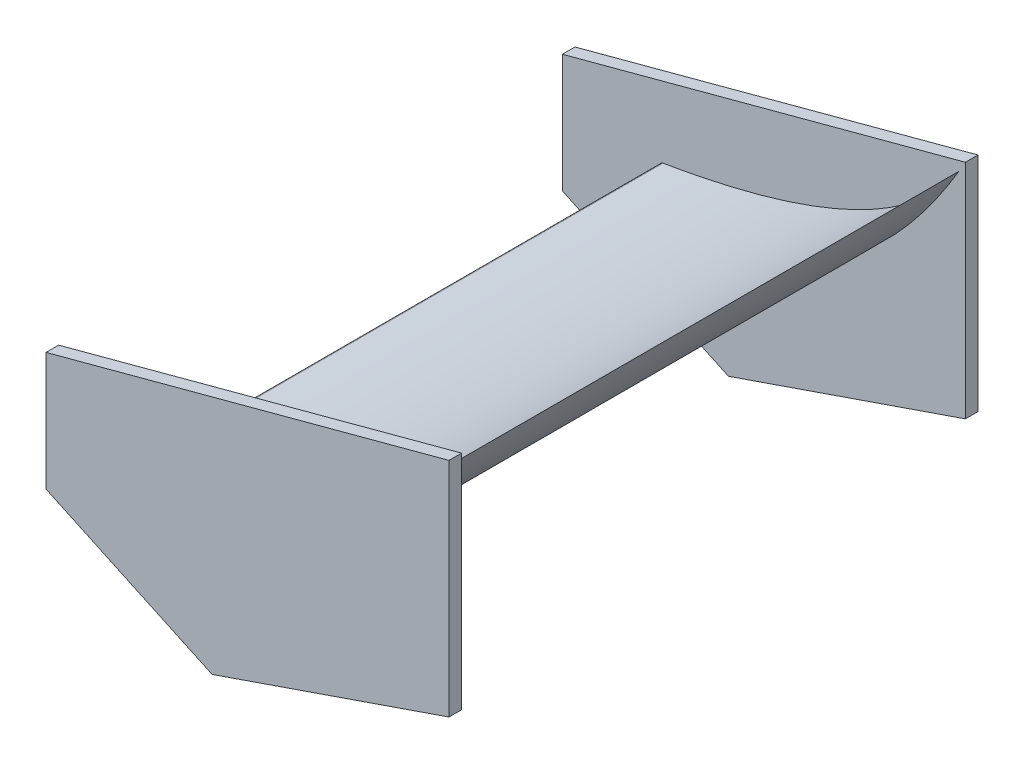
ISO-10303-21;
HEADER;
FILE_DESCRIPTION(('STEP AP214'),'2;1');
FILE_NAME('part.step','',(''),(''),'','','');
FILE_SCHEMA(('AUTOMOTIVE_DESIGN { 1 0 10303 214 1 1 1 1 }'));
ENDSEC;
DATA;
#1=APPLICATION_CONTEXT('core data for automotive mechanical design processes');
#2=APPLICATION_PROTOCOL_DEFINITION('international standard','automotive_design',2000,#1);
#3=PRODUCT_CONTEXT('',#1,'mechanical');
#4=PRODUCT('Part','Part','',(#3));
#5=PRODUCT_RELATED_PRODUCT_CATEGORY('part','',(#4));
#6=PRODUCT_DEFINITION_FORMATION('','',#4);
#7=PRODUCT_DEFINITION_CONTEXT('part definition',#1,'design');
#8=PRODUCT_DEFINITION('design','',#6,#7);
#9=PRODUCT_DEFINITION_SHAPE('','',#8);
#10=(LENGTH_UNIT() NAMED_UNIT(*) SI_UNIT(.MILLI.,.METRE.));
#11=(NAMED_UNIT(*) PLANE_ANGLE_UNIT() SI_UNIT($,.RADIAN.));
#12=(NAMED_UNIT(*) SI_UNIT($,.STERADIAN.) SOLID_ANGLE_UNIT());
#13=UNCERTAINTY_MEASURE_WITH_UNIT(LENGTH_MEASURE(1.E-05),#10,'distance_accuracy_value','');
#14=(GEOMETRIC_REPRESENTATION_CONTEXT(3) GLOBAL_UNCERTAINTY_ASSIGNED_CONTEXT((#13)) GLOBAL_UNIT_ASSIGNED_CONTEXT((#10,
#11,#12)) REPRESENTATION_CONTEXT('',''));
#15=CARTESIAN_POINT('',(0.,0.,0.));
#16=DIRECTION('',(0.,0.,1.));
#17=DIRECTION('',(1.,0.,0.));
#18=AXIS2_PLACEMENT_3D('',#15,#16,#17);
#19=CARTESIAN_POINT('',(381.424295223492,794.650430858613,500.));
#20=DIRECTION('',(0.,0.,-1.));
#21=DIRECTION('',(-1.,0.,0.));
#22=AXIS2_PLACEMENT_3D('',#19,#20,#21);
#23=CYLINDRICAL_SURFACE('',#22,7.00000000000001);
#24=CARTESIAN_POINT('',(381.424295223492,794.650430858613,-500.));
#25=DIRECTION('',(0.,0.,1.));
#26=DIRECTION('',(1.,0.,0.));
#27=AXIS2_PLACEMENT_3D('',#24,#25,#26);
#28=CIRCLE('',#27,7.00000000000001);
#29=CARTESIAN_POINT('',(380.27721687436,801.555806392279,-500.));
#30=VERTEX_POINT('',#29);
#31=CARTESIAN_POINT('',(375.337243967888,791.193870861788,-500.));
#32=VERTEX_POINT('',#31);
#33=EDGE_CURVE('E98',#30,#32,#28,.T.);
#34=ORIENTED_EDGE('',*,*,#33,.T.);
#35=DIRECTION('',(0.,0.,-1.));
#36=VECTOR('',#35,1.);
#37=CARTESIAN_POINT('',(375.337243967888,791.193870861788,500.));
#38=LINE('',#37,#36);
#39=CARTESIAN_POINT('',(375.337243967888,791.193870861788,500.));
#40=VERTEX_POINT('',#39);
#41=EDGE_CURVE('E12',#40,#32,#38,.T.);
#42=ORIENTED_EDGE('',*,*,#41,.F.);
#43=CARTESIAN_POINT('',(381.424295223492,794.650430858613,500.));
#44=DIRECTION('',(0.,0.,1.));
#45=DIRECTION('',(1.,0.,0.));
#46=AXIS2_PLACEMENT_3D('',#43,#44,#45);
#47=CIRCLE('',#46,7.00000000000001);
#48=CARTESIAN_POINT('',(380.27721687436,801.555806392279,500.));
#49=VERTEX_POINT('',#48);
#50=EDGE_CURVE('E91',#49,#40,#47,.T.);
#51=ORIENTED_EDGE('',*,*,#50,.F.);
#52=DIRECTION('',(0.,0.,-1.));
#53=VECTOR('',#52,1.);
#54=CARTESIAN_POINT('',(380.27721687436,801.555806392279,500.));
#55=LINE('',#54,#53);
#56=EDGE_CURVE('E99',#49,#30,#55,.T.);
#57=ORIENTED_EDGE('',*,*,#56,.T.);
#58=EDGE_LOOP('',(#34,#42,#51,#57));
#59=FACE_BOUND('',#58,.T.);
#60=ADVANCED_FACE('F51',(#59),#23,.T.);
#61=CARTESIAN_POINT('',(375.337243967888,791.193870861788,500.));
#62=CARTESIAN_POINT('',(722.629462289645,653.636276188608,500.));
#63=CARTESIAN_POINT('',(980.27721687436,1103.11161278456,500.));
#64=B_SPLINE_CURVE_WITH_KNOTS('',2,(#61,#62,#63),.UNSPECIFIED.,.F.,.F.,(3,3),(0.,1.),.UNSPECIFIED.);
#65=DIRECTION('',(0.,0.,-1.));
#66=VECTOR('',#65,1.);
#67=SURFACE_OF_LINEAR_EXTRUSION('',#64,#66);
#68=CARTESIAN_POINT('',(375.337243967888,791.193870861788,-500.));
#69=CARTESIAN_POINT('',(722.629462289645,653.636276188608,-500.));
#70=CARTESIAN_POINT('',(980.27721687436,1103.11161278456,-500.));
#71=B_SPLINE_CURVE_WITH_KNOTS('',2,(#68,#69,#70),.UNSPECIFIED.,.F.,.F.,(3,3),(0.,1.),.UNSPECIFIED.);
#72=CARTESIAN_POINT('',(967.403573874035,1081.11311876212,-500.));
#73=VERTEX_POINT('',#72);
#74=EDGE_CURVE('E79',#32,#73,#71,.T.);
#75=ORIENTED_EDGE('',*,*,#74,.T.);
#76=DIRECTION('',(0.,0.,-1.));
#77=VECTOR('',#76,1.);
#78=CARTESIAN_POINT('',(967.403573874035,1081.11311876212,500.));
#79=LINE('',#78,#77);
#80=CARTESIAN_POINT('',(967.403573874035,1081.11311876212,500.));
#81=VERTEX_POINT('',#80);
#82=EDGE_CURVE('E59',#81,#73,#79,.T.);
#83=ORIENTED_EDGE('',*,*,#82,.F.);
#84=EDGE_CURVE('E87',#40,#81,#64,.T.);
#85=ORIENTED_EDGE('',*,*,#84,.F.);
#86=ORIENTED_EDGE('',*,*,#41,.T.);
#87=EDGE_LOOP('',(#75,#83,#85,#86));
#88=FACE_BOUND('',#87,.T.);
#89=ADVANCED_FACE('F88',(#88),#67,.F.);
#90=CARTESIAN_POINT('',(980.27721687436,1103.11161278456,500.));
#91=CARTESIAN_POINT('',(861.874697213353,881.555806392279,500.));
#92=CARTESIAN_POINT('',(380.27721687436,801.555806392279,500.));
#93=B_SPLINE_CURVE_WITH_KNOTS('',2,(#90,#91,#92),.UNSPECIFIED.,.F.,.F.,(3,3),(0.,1.),.UNSPECIFIED.);
#94=DIRECTION('',(0.,0.,-1.));
#95=VECTOR('',#94,1.);
#96=SURFACE_OF_LINEAR_EXTRUSION('',#93,#95);
#97=CARTESIAN_POINT('',(980.27721687436,1103.11161278456,-500.));
#98=CARTESIAN_POINT('',(861.874697213353,881.555806392279,-500.));
#99=CARTESIAN_POINT('',(380.27721687436,801.555806392279,-500.));
#100=B_SPLINE_CURVE_WITH_KNOTS('',2,(#97,#98,#99),.UNSPECIFIED.,.F.,.F.,(3,3),(0.,1.),.UNSPECIFIED.);
#101=EDGE_CURVE('E84',#73,#30,#100,.T.);
#102=ORIENTED_EDGE('',*,*,#101,.T.);
#103=ORIENTED_EDGE('',*,*,#56,.F.);
#104=EDGE_CURVE('E67',#81,#49,#93,.T.);
#105=ORIENTED_EDGE('',*,*,#104,.F.);
#106=ORIENTED_EDGE('',*,*,#82,.T.);
#107=EDGE_LOOP('',(#102,#103,#105,#106));
#108=FACE_BOUND('',#107,.T.);
#109=ADVANCED_FACE('F119',(#108),#96,.F.);
#110=CARTESIAN_POINT('',(0.,0.,500.));
#111=DIRECTION('',(0.,0.,1.));
#112=DIRECTION('',(1.,0.,0.));
#113=AXIS2_PLACEMENT_3D('',#110,#111,#112);
#114=PLANE('',#113);
#115=ORIENTED_EDGE('',*,*,#50,.T.);
#116=ORIENTED_EDGE('',*,*,#84,.T.);
#117=ORIENTED_EDGE('',*,*,#104,.T.);
#118=EDGE_LOOP('',(#115,#116,#117));
#119=FACE_BOUND('',#118,.T.);
#120=ADVANCED_FACE('F94',(#119),#114,.T.);
#121=CARTESIAN_POINT('',(0.,0.,-500.));
#122=DIRECTION('',(0.,0.,1.));
#123=DIRECTION('',(1.,0.,0.));
#124=AXIS2_PLACEMENT_3D('',#121,#122,#123);
#125=PLANE('',#124);
#126=ORIENTED_EDGE('',*,*,#33,.F.);
#127=ORIENTED_EDGE('',*,*,#101,.F.);
#128=ORIENTED_EDGE('',*,*,#74,.F.);
#129=EDGE_LOOP('',(#126,#127,#128));
#130=FACE_BOUND('',#129,.T.);
#131=ADVANCED_FACE('F120',(#130),#125,.F.);
#132=CLOSED_SHELL('',(#60,#89,#109,#120,#131));
#133=MANIFOLD_SOLID_BREP('B2',#132);
#134=CARTESIAN_POINT('',(980.27721687436,0.,-525.));
#135=DIRECTION('',(1.,0.,0.));
#136=DIRECTION('',(0.,0.,1.));
#137=AXIS2_PLACEMENT_3D('',#134,#135,#136);
#138=PLANE('',#137);
#139=DIRECTION('',(0.,-1.,0.));
#140=VECTOR('',#139,1.);
#141=CARTESIAN_POINT('',(980.27721687436,0.,-500.));
#142=LINE('',#141,#140);
#143=CARTESIAN_POINT('',(980.27721687436,1103.11161278456,-500.));
#144=VERTEX_POINT('',#143);
#145=CARTESIAN_POINT('',(980.27721687436,661.929431670851,-500.));
#146=VERTEX_POINT('',#145);
#147=EDGE_CURVE('E254',#144,#146,#142,.T.);
#148=ORIENTED_EDGE('',*,*,#147,.T.);
#149=DIRECTION('',(0.,0.,1.));
#150=VECTOR('',#149,1.);
#151=CARTESIAN_POINT('',(980.27721687436,661.929431670851,-525.));
#152=LINE('',#151,#150);
#153=CARTESIAN_POINT('',(980.27721687436,661.929431670851,-525.));
#154=VERTEX_POINT('',#153);
#155=EDGE_CURVE('E253',#154,#146,#152,.T.);
#156=ORIENTED_EDGE('',*,*,#155,.F.);
#157=DIRECTION('',(0.,-1.,0.));
#158=VECTOR('',#157,1.);
#159=CARTESIAN_POINT('',(980.27721687436,0.,-525.));
#160=LINE('',#159,#158);
#161=CARTESIAN_POINT('',(980.27721687436,1103.11161278456,-525.));
#162=VERTEX_POINT('',#161);
#163=EDGE_CURVE('E248',#162,#154,#160,.T.);
#164=ORIENTED_EDGE('',*,*,#163,.F.);
#165=DIRECTION('',(0.,0.,1.));
#166=VECTOR('',#165,1.);
#167=CARTESIAN_POINT('',(980.27721687436,1103.11161278456,-525.));
#168=LINE('',#167,#166);
#169=EDGE_CURVE('E49',#162,#144,#168,.T.);
#170=ORIENTED_EDGE('',*,*,#169,.T.);
#171=EDGE_LOOP('',(#148,#156,#164,#170));
#172=FACE_BOUND('',#171,.T.);
#173=ADVANCED_FACE('F179',(#172),#138,.T.);
#174=CARTESIAN_POINT('',(-210.11178104111,784.147842114219,-525.));
#175=DIRECTION('',(0.258819045102518,-0.965925826289069,0.));
#176=DIRECTION('',(0.965925826289069,0.258819045102518,0.));
#177=AXIS2_PLACEMENT_3D('',#174,#175,#176);
#178=PLANE('',#177);
#179=DIRECTION('',(-0.965925826289069,-0.258819045102518,0.));
#180=VECTOR('',#179,1.);
#181=CARTESIAN_POINT('',(-210.11178104111,784.147842114219,-500.));
#182=LINE('',#181,#180);
#183=CARTESIAN_POINT('',(180.27721687436,888.752258839663,-500.));
#184=VERTEX_POINT('',#183);
#185=EDGE_CURVE('E257',#144,#184,#182,.T.);
#186=ORIENTED_EDGE('',*,*,#185,.F.);
#187=ORIENTED_EDGE('',*,*,#169,.F.);
#188=DIRECTION('',(-0.965925826289069,-0.258819045102518,0.));
#189=VECTOR('',#188,1.);
#190=CARTESIAN_POINT('',(-210.11178104111,784.147842114219,-525.));
#191=LINE('',#190,#189);
#192=CARTESIAN_POINT('',(180.27721687436,888.752258839663,-525.));
#193=VERTEX_POINT('',#192);
#194=EDGE_CURVE('E224',#162,#193,#191,.T.);
#195=ORIENTED_EDGE('',*,*,#194,.T.);
#196=DIRECTION('',(0.,0.,1.));
#197=VECTOR('',#196,1.);
#198=CARTESIAN_POINT('',(180.27721687436,888.752258839663,-525.));
#199=LINE('',#198,#197);
#200=EDGE_CURVE('E187',#193,#184,#199,.T.);
#201=ORIENTED_EDGE('',*,*,#200,.T.);
#202=EDGE_LOOP('',(#186,#187,#195,#201));
#203=FACE_BOUND('',#202,.T.);
#204=ADVANCED_FACE('F266',(#203),#178,.F.);
#205=CARTESIAN_POINT('',(180.27721687436,0.,-525.));
#206=DIRECTION('',(1.,0.,0.));
#207=DIRECTION('',(0.,1.,0.));
#208=AXIS2_PLACEMENT_3D('',#205,#206,#207);
#209=PLANE('',#208);
#210=DIRECTION('',(0.,-1.,0.));
#211=VECTOR('',#210,1.);
#212=CARTESIAN_POINT('',(180.27721687436,0.,-500.));
#213=LINE('',#212,#211);
#214=CARTESIAN_POINT('',(180.27721687436,653.752258839663,-500.));
#215=VERTEX_POINT('',#214);
#216=EDGE_CURVE('E260',#184,#215,#213,.T.);
#217=ORIENTED_EDGE('',*,*,#216,.F.);
#218=ORIENTED_EDGE('',*,*,#200,.F.);
#219=DIRECTION('',(0.,-1.,0.));
#220=VECTOR('',#219,1.);
#221=CARTESIAN_POINT('',(180.27721687436,0.,-525.));
#222=LINE('',#221,#220);
#223=CARTESIAN_POINT('',(180.27721687436,653.752258839663,-525.));
#224=VERTEX_POINT('',#223);
#225=EDGE_CURVE('E233',#193,#224,#222,.T.);
#226=ORIENTED_EDGE('',*,*,#225,.T.);
#227=DIRECTION('',(0.,0.,1.));
#228=VECTOR('',#227,1.);
#229=CARTESIAN_POINT('',(180.27721687436,653.752258839663,-525.));
#230=LINE('',#229,#228);
#231=EDGE_CURVE('E238',#224,#215,#230,.T.);
#232=ORIENTED_EDGE('',*,*,#231,.T.);
#233=EDGE_LOOP('',(#217,#218,#226,#232));
#234=FACE_BOUND('',#233,.T.);
#235=ADVANCED_FACE('F245',(#234),#209,.F.);
#236=CARTESIAN_POINT('',(282.600270309672,606.038235416975,-525.));
#237=DIRECTION('',(0.422618261740693,0.906307787036653,0.));
#238=DIRECTION('',(-0.906307787036653,0.422618261740693,0.));
#239=AXIS2_PLACEMENT_3D('',#236,#237,#238);
#240=PLANE('',#239);
#241=DIRECTION('',(0.906307787036653,-0.422618261740693,0.));
#242=VECTOR('',#241,1.);
#243=CARTESIAN_POINT('',(282.600270309672,606.038235416975,-500.));
#244=LINE('',#243,#242);
#245=CARTESIAN_POINT('',(510.,500.,-500.));
#246=VERTEX_POINT('',#245);
#247=EDGE_CURVE('E240',#215,#246,#244,.T.);
#248=ORIENTED_EDGE('',*,*,#247,.F.);
#249=ORIENTED_EDGE('',*,*,#231,.F.);
#250=DIRECTION('',(0.906307787036653,-0.422618261740693,0.));
#251=VECTOR('',#250,1.);
#252=CARTESIAN_POINT('',(282.600270309672,606.038235416975,-525.));
#253=LINE('',#252,#251);
#254=CARTESIAN_POINT('',(510.,500.,-525.));
#255=VERTEX_POINT('',#254);
#256=EDGE_CURVE('E229',#224,#255,#253,.T.);
#257=ORIENTED_EDGE('',*,*,#256,.T.);
#258=DIRECTION('',(0.,0.,1.));
#259=VECTOR('',#258,1.);
#260=CARTESIAN_POINT('',(510.,500.,-525.));
#261=LINE('',#260,#259);
#262=EDGE_CURVE('E243',#255,#246,#261,.T.);
#263=ORIENTED_EDGE('',*,*,#262,.T.);
#264=EDGE_LOOP('',(#248,#249,#257,#263));
#265=FACE_BOUND('',#264,.T.);
#266=ADVANCED_FACE('F239',(#265),#240,.F.);
#267=CARTESIAN_POINT('',(-99.8581110011282,290.009012193642,-525.));
#268=DIRECTION('',(-0.325568154457151,0.945518575599319,0.));
#269=DIRECTION('',(-0.945518575599319,-0.325568154457151,0.));
#270=AXIS2_PLACEMENT_3D('',#267,#268,#269);
#271=PLANE('',#270);
#272=DIRECTION('',(0.945518575599319,0.325568154457151,0.));
#273=VECTOR('',#272,1.);
#274=CARTESIAN_POINT('',(-99.8581110011282,290.009012193642,-500.));
#275=LINE('',#274,#273);
#276=EDGE_CURVE('E212',#246,#146,#275,.T.);
#277=ORIENTED_EDGE('',*,*,#276,.F.);
#278=ORIENTED_EDGE('',*,*,#262,.F.);
#279=DIRECTION('',(0.945518575599319,0.325568154457151,0.));
#280=VECTOR('',#279,1.);
#281=CARTESIAN_POINT('',(-99.8581110011282,290.009012193642,-525.));
#282=LINE('',#281,#280);
#283=EDGE_CURVE('E195',#255,#154,#282,.T.);
#284=ORIENTED_EDGE('',*,*,#283,.T.);
#285=ORIENTED_EDGE('',*,*,#155,.T.);
#286=EDGE_LOOP('',(#277,#278,#284,#285));
#287=FACE_BOUND('',#286,.T.);
#288=ADVANCED_FACE('F271',(#287),#271,.F.);
#289=CARTESIAN_POINT('',(0.,0.,-525.));
#290=DIRECTION('',(0.,0.,-1.));
#291=DIRECTION('',(1.,0.,0.));
#292=AXIS2_PLACEMENT_3D('',#289,#290,#291);
#293=PLANE('',#292);
#294=ORIENTED_EDGE('',*,*,#163,.T.);
#295=ORIENTED_EDGE('',*,*,#283,.F.);
#296=ORIENTED_EDGE('',*,*,#256,.F.);
#297=ORIENTED_EDGE('',*,*,#225,.F.);
#298=ORIENTED_EDGE('',*,*,#194,.F.);
#299=EDGE_LOOP('',(#294,#295,#296,#297,#298));
#300=FACE_BOUND('',#299,.T.);
#301=ADVANCED_FACE('F231',(#300),#293,.T.);
#302=CARTESIAN_POINT('',(0.,0.,-500.));
#303=DIRECTION('',(0.,0.,-1.));
#304=DIRECTION('',(1.,0.,0.));
#305=AXIS2_PLACEMENT_3D('',#302,#303,#304);
#306=PLANE('',#305);
#307=ORIENTED_EDGE('',*,*,#147,.F.);
#308=ORIENTED_EDGE('',*,*,#185,.T.);
#309=ORIENTED_EDGE('',*,*,#216,.T.);
#310=ORIENTED_EDGE('',*,*,#247,.T.);
#311=ORIENTED_EDGE('',*,*,#276,.T.);
#312=EDGE_LOOP('',(#307,#308,#309,#310,#311));
#313=FACE_BOUND('',#312,.T.);
#314=ADVANCED_FACE('F267',(#313),#306,.F.);
#315=CLOSED_SHELL('',(#173,#204,#235,#266,#288,#301,#314));
#316=MANIFOLD_SOLID_BREP('B6',#315);
#317=CARTESIAN_POINT('',(980.27721687436,0.,525.));
#318=DIRECTION('',(1.,0.,0.));
#319=DIRECTION('',(0.,0.,-1.));
#320=AXIS2_PLACEMENT_3D('',#317,#318,#319);
#321=PLANE('',#320);
#322=DIRECTION('',(0.,-1.,0.));
#323=VECTOR('',#322,1.);
#324=CARTESIAN_POINT('',(980.27721687436,0.,500.));
#325=LINE('',#324,#323);
#326=CARTESIAN_POINT('',(980.27721687436,1103.11161278456,500.));
#327=VERTEX_POINT('',#326);
#328=CARTESIAN_POINT('',(980.27721687436,661.929431670851,500.));
#329=VERTEX_POINT('',#328);
#330=EDGE_CURVE('E401',#327,#329,#325,.T.);
#331=ORIENTED_EDGE('',*,*,#330,.F.);
#332=DIRECTION('',(0.,0.,-1.));
#333=VECTOR('',#332,1.);
#334=CARTESIAN_POINT('',(980.27721687436,1103.11161278456,525.));
#335=LINE('',#334,#333);
#336=CARTESIAN_POINT('',(980.27721687436,1103.11161278456,525.));
#337=VERTEX_POINT('',#336);
#338=EDGE_CURVE('E177',#337,#327,#335,.T.);
#339=ORIENTED_EDGE('',*,*,#338,.F.);
#340=DIRECTION('',(0.,-1.,0.));
#341=VECTOR('',#340,1.);
#342=CARTESIAN_POINT('',(980.27721687436,0.,525.));
#343=LINE('',#342,#341);
#344=CARTESIAN_POINT('',(980.27721687436,661.929431670851,525.));
#345=VERTEX_POINT('',#344);
#346=EDGE_CURVE('E410',#337,#345,#343,.T.);
#347=ORIENTED_EDGE('',*,*,#346,.T.);
#348=DIRECTION('',(0.,0.,-1.));
#349=VECTOR('',#348,1.);
#350=CARTESIAN_POINT('',(980.27721687436,661.929431670851,525.));
#351=LINE('',#350,#349);
#352=EDGE_CURVE('E370',#345,#329,#351,.T.);
#353=ORIENTED_EDGE('',*,*,#352,.T.);
#354=EDGE_LOOP('',(#331,#339,#347,#353));
#355=FACE_BOUND('',#354,.T.);
#356=ADVANCED_FACE('F328',(#355),#321,.T.);
#357=CARTESIAN_POINT('',(-210.11178104111,784.147842114219,525.));
#358=DIRECTION('',(0.258819045102518,-0.965925826289069,0.));
#359=DIRECTION('',(0.965925826289069,0.258819045102518,0.));
#360=AXIS2_PLACEMENT_3D('',#357,#358,#359);
#361=PLANE('',#360);
#362=DIRECTION('',(-0.965925826289069,-0.258819045102518,0.));
#363=VECTOR('',#362,1.);
#364=CARTESIAN_POINT('',(-210.11178104111,784.147842114219,500.));
#365=LINE('',#364,#363);
#366=CARTESIAN_POINT('',(180.27721687436,888.752258839663,500.));
#367=VERTEX_POINT('',#366);
#368=EDGE_CURVE('E404',#327,#367,#365,.T.);
#369=ORIENTED_EDGE('',*,*,#368,.T.);
#370=DIRECTION('',(0.,0.,-1.));
#371=VECTOR('',#370,1.);
#372=CARTESIAN_POINT('',(180.27721687436,888.752258839663,525.));
#373=LINE('',#372,#371);
#374=CARTESIAN_POINT('',(180.27721687436,888.752258839663,525.));
#375=VERTEX_POINT('',#374);
#376=EDGE_CURVE('E336',#375,#367,#373,.T.);
#377=ORIENTED_EDGE('',*,*,#376,.F.);
#378=DIRECTION('',(-0.965925826289069,-0.258819045102518,0.));
#379=VECTOR('',#378,1.);
#380=CARTESIAN_POINT('',(-210.11178104111,784.147842114219,525.));
#381=LINE('',#380,#379);
#382=EDGE_CURVE('E385',#337,#375,#381,.T.);
#383=ORIENTED_EDGE('',*,*,#382,.F.);
#384=ORIENTED_EDGE('',*,*,#338,.T.);
#385=EDGE_LOOP('',(#369,#377,#383,#384));
#386=FACE_BOUND('',#385,.T.);
#387=ADVANCED_FACE('F421',(#386),#361,.F.);
#388=CARTESIAN_POINT('',(180.27721687436,0.,525.));
#389=DIRECTION('',(1.,0.,0.));
#390=DIRECTION('',(0.,1.,0.));
#391=AXIS2_PLACEMENT_3D('',#388,#389,#390);
#392=PLANE('',#391);
#393=DIRECTION('',(0.,-1.,0.));
#394=VECTOR('',#393,1.);
#395=CARTESIAN_POINT('',(180.27721687436,0.,500.));
#396=LINE('',#395,#394);
#397=CARTESIAN_POINT('',(180.27721687436,653.752258839663,500.));
#398=VERTEX_POINT('',#397);
#399=EDGE_CURVE('E393',#367,#398,#396,.T.);
#400=ORIENTED_EDGE('',*,*,#399,.T.);
#401=DIRECTION('',(0.,0.,-1.));
#402=VECTOR('',#401,1.);
#403=CARTESIAN_POINT('',(180.27721687436,653.752258839663,525.));
#404=LINE('',#403,#402);
#405=CARTESIAN_POINT('',(180.27721687436,653.752258839663,525.));
#406=VERTEX_POINT('',#405);
#407=EDGE_CURVE('E390',#406,#398,#404,.T.);
#408=ORIENTED_EDGE('',*,*,#407,.F.);
#409=DIRECTION('',(0.,-1.,0.));
#410=VECTOR('',#409,1.);
#411=CARTESIAN_POINT('',(180.27721687436,0.,525.));
#412=LINE('',#411,#410);
#413=EDGE_CURVE('E380',#375,#406,#412,.T.);
#414=ORIENTED_EDGE('',*,*,#413,.F.);
#415=ORIENTED_EDGE('',*,*,#376,.T.);
#416=EDGE_LOOP('',(#400,#408,#414,#415));
#417=FACE_BOUND('',#416,.T.);
#418=ADVANCED_FACE('F391',(#417),#392,.F.);
#419=CARTESIAN_POINT('',(282.600270309672,606.038235416975,525.));
#420=DIRECTION('',(0.422618261740693,0.906307787036653,0.));
#421=DIRECTION('',(-0.906307787036653,0.422618261740693,0.));
#422=AXIS2_PLACEMENT_3D('',#419,#420,#421);
#423=PLANE('',#422);
#424=DIRECTION('',(0.906307787036653,-0.422618261740693,0.));
#425=VECTOR('',#424,1.);
#426=CARTESIAN_POINT('',(282.600270309672,606.038235416975,500.));
#427=LINE('',#426,#425);
#428=CARTESIAN_POINT('',(510.,500.,500.));
#429=VERTEX_POINT('',#428);
#430=EDGE_CURVE('E363',#398,#429,#427,.T.);
#431=ORIENTED_EDGE('',*,*,#430,.T.);
#432=DIRECTION('',(0.,0.,-1.));
#433=VECTOR('',#432,1.);
#434=CARTESIAN_POINT('',(510.,500.,525.));
#435=LINE('',#434,#433);
#436=CARTESIAN_POINT('',(510.,500.,525.));
#437=VERTEX_POINT('',#436);
#438=EDGE_CURVE('E394',#437,#429,#435,.T.);
#439=ORIENTED_EDGE('',*,*,#438,.F.);
#440=DIRECTION('',(0.906307787036653,-0.422618261740693,0.));
#441=VECTOR('',#440,1.);
#442=CARTESIAN_POINT('',(282.600270309672,606.038235416975,525.));
#443=LINE('',#442,#441);
#444=EDGE_CURVE('E384',#406,#437,#443,.T.);
#445=ORIENTED_EDGE('',*,*,#444,.F.);
#446=ORIENTED_EDGE('',*,*,#407,.T.);
#447=EDGE_LOOP('',(#431,#439,#445,#446));
#448=FACE_BOUND('',#447,.T.);
#449=ADVANCED_FACE('F396',(#448),#423,.F.);
#450=CARTESIAN_POINT('',(-99.8581110011282,290.009012193642,525.));
#451=DIRECTION('',(-0.325568154457151,0.945518575599319,0.));
#452=DIRECTION('',(-0.945518575599319,-0.325568154457151,0.));
#453=AXIS2_PLACEMENT_3D('',#450,#451,#452);
#454=PLANE('',#453);
#455=DIRECTION('',(0.945518575599319,0.325568154457151,0.));
#456=VECTOR('',#455,1.);
#457=CARTESIAN_POINT('',(-99.8581110011282,290.009012193642,500.));
#458=LINE('',#457,#456);
#459=EDGE_CURVE('E408',#429,#329,#458,.T.);
#460=ORIENTED_EDGE('',*,*,#459,.T.);
#461=ORIENTED_EDGE('',*,*,#352,.F.);
#462=DIRECTION('',(0.945518575599319,0.325568154457151,0.));
#463=VECTOR('',#462,1.);
#464=CARTESIAN_POINT('',(-99.8581110011282,290.009012193642,525.));
#465=LINE('',#464,#463);
#466=EDGE_CURVE('E344',#437,#345,#465,.T.);
#467=ORIENTED_EDGE('',*,*,#466,.F.);
#468=ORIENTED_EDGE('',*,*,#438,.T.);
#469=EDGE_LOOP('',(#460,#461,#467,#468));
#470=FACE_BOUND('',#469,.T.);
#471=ADVANCED_FACE('F418',(#470),#454,.F.);
#472=CARTESIAN_POINT('',(0.,0.,525.));
#473=DIRECTION('',(0.,0.,1.));
#474=DIRECTION('',(1.,0.,0.));
#475=AXIS2_PLACEMENT_3D('',#472,#473,#474);
#476=PLANE('',#475);
#477=ORIENTED_EDGE('',*,*,#346,.F.);
#478=ORIENTED_EDGE('',*,*,#382,.T.);
#479=ORIENTED_EDGE('',*,*,#413,.T.);
#480=ORIENTED_EDGE('',*,*,#444,.T.);
#481=ORIENTED_EDGE('',*,*,#466,.T.);
#482=EDGE_LOOP('',(#477,#478,#479,#480,#481));
#483=FACE_BOUND('',#482,.T.);
#484=ADVANCED_FACE('F382',(#483),#476,.T.);
#485=CARTESIAN_POINT('',(0.,0.,500.));
#486=DIRECTION('',(0.,0.,1.));
#487=DIRECTION('',(1.,0.,0.));
#488=AXIS2_PLACEMENT_3D('',#485,#486,#487);
#489=PLANE('',#488);
#490=ORIENTED_EDGE('',*,*,#330,.T.);
#491=ORIENTED_EDGE('',*,*,#459,.F.);
#492=ORIENTED_EDGE('',*,*,#430,.F.);
#493=ORIENTED_EDGE('',*,*,#399,.F.);
#494=ORIENTED_EDGE('',*,*,#368,.F.);
#495=EDGE_LOOP('',(#490,#491,#492,#493,#494));
#496=FACE_BOUND('',#495,.T.);
#497=ADVANCED_FACE('F415',(#496),#489,.F.);
#498=CLOSED_SHELL('',(#356,#387,#418,#449,#471,#484,#497));
#499=MANIFOLD_SOLID_BREP('B43',#498);
#500=ADVANCED_BREP_SHAPE_REPRESENTATION('',(#18,#133,#316,#499),#14);
#501=SHAPE_DEFINITION_REPRESENTATION(#9,#500);
ENDSEC;
END-ISO-10303-21;
